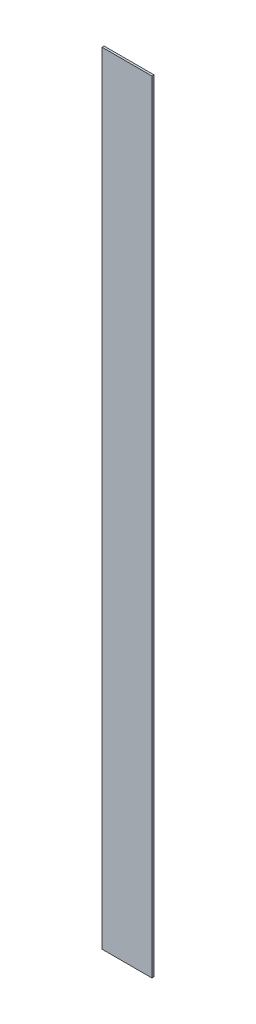
ISO-10303-21;
HEADER;
FILE_DESCRIPTION(('STEP AP214'),'2;1');
FILE_NAME('part.step','',(''),(''),'','','');
FILE_SCHEMA(('AUTOMOTIVE_DESIGN { 1 0 10303 214 1 1 1 1 }'));
ENDSEC;
DATA;
#1=APPLICATION_CONTEXT('core data for automotive mechanical design processes');
#2=APPLICATION_PROTOCOL_DEFINITION('international standard','automotive_design',2000,#1);
#3=PRODUCT_CONTEXT('',#1,'mechanical');
#4=PRODUCT('Part','Part','',(#3));
#5=PRODUCT_RELATED_PRODUCT_CATEGORY('part','',(#4));
#6=PRODUCT_DEFINITION_FORMATION('','',#4);
#7=PRODUCT_DEFINITION_CONTEXT('part definition',#1,'design');
#8=PRODUCT_DEFINITION('design','',#6,#7);
#9=PRODUCT_DEFINITION_SHAPE('','',#8);
#10=(LENGTH_UNIT() NAMED_UNIT(*) SI_UNIT(.MILLI.,.METRE.));
#11=(NAMED_UNIT(*) PLANE_ANGLE_UNIT() SI_UNIT($,.RADIAN.));
#12=(NAMED_UNIT(*) SI_UNIT($,.STERADIAN.) SOLID_ANGLE_UNIT());
#13=UNCERTAINTY_MEASURE_WITH_UNIT(LENGTH_MEASURE(1.E-05),#10,'distance_accuracy_value','');
#14=(GEOMETRIC_REPRESENTATION_CONTEXT(3) GLOBAL_UNCERTAINTY_ASSIGNED_CONTEXT((#13)) GLOBAL_UNIT_ASSIGNED_CONTEXT((#10,
#11,#12)) REPRESENTATION_CONTEXT('',''));
#15=CARTESIAN_POINT('',(0.,0.,0.));
#16=DIRECTION('',(0.,0.,1.));
#17=DIRECTION('',(1.,0.,0.));
#18=AXIS2_PLACEMENT_3D('',#15,#16,#17);
#19=CARTESIAN_POINT('',(-59.2525929806181,1415.46071241488,4.));
#20=DIRECTION('',(0.,1.,0.));
#21=DIRECTION('',(0.,0.,1.));
#22=AXIS2_PLACEMENT_3D('',#19,#20,#21);
#23=PLANE('',#22);
#24=DIRECTION('',(1.,0.,0.));
#25=VECTOR('',#24,1.);
#26=CARTESIAN_POINT('',(-59.2525929806181,1415.46071241488,0.));
#27=LINE('',#26,#25);
#28=CARTESIAN_POINT('',(-59.2525929806181,1415.46071241488,0.));
#29=VERTEX_POINT('',#28);
#30=CARTESIAN_POINT('',(36.7474070193817,1415.46071241488,0.));
#31=VERTEX_POINT('',#30);
#32=EDGE_CURVE('E97',#29,#31,#27,.T.);
#33=ORIENTED_EDGE('',*,*,#32,.F.);
#34=DIRECTION('',(0.,0.,-1.));
#35=VECTOR('',#34,1.);
#36=CARTESIAN_POINT('',(-59.2525929806181,1415.46071241488,4.));
#37=LINE('',#36,#35);
#38=CARTESIAN_POINT('',(-59.2525929806181,1415.46071241488,4.));
#39=VERTEX_POINT('',#38);
#40=EDGE_CURVE('E11',#39,#29,#37,.T.);
#41=ORIENTED_EDGE('',*,*,#40,.F.);
#42=DIRECTION('',(1.,0.,0.));
#43=VECTOR('',#42,1.);
#44=CARTESIAN_POINT('',(-59.2525929806181,1415.46071241488,4.));
#45=LINE('',#44,#43);
#46=CARTESIAN_POINT('',(36.7474070193817,1415.46071241488,4.));
#47=VERTEX_POINT('',#46);
#48=EDGE_CURVE('E91',#39,#47,#45,.T.);
#49=ORIENTED_EDGE('',*,*,#48,.T.);
#50=DIRECTION('',(0.,0.,-1.));
#51=VECTOR('',#50,1.);
#52=CARTESIAN_POINT('',(36.7474070193817,1415.46071241488,4.));
#53=LINE('',#52,#51);
#54=EDGE_CURVE('E36',#47,#31,#53,.T.);
#55=ORIENTED_EDGE('',*,*,#54,.T.);
#56=EDGE_LOOP('',(#33,#41,#49,#55));
#57=FACE_BOUND('',#56,.T.);
#58=ADVANCED_FACE('F33',(#57),#23,.T.);
#59=CARTESIAN_POINT('',(-59.2525929806181,-88.5392875851231,4.));
#60=DIRECTION('',(-1.,0.,0.));
#61=DIRECTION('',(0.,0.,1.));
#62=AXIS2_PLACEMENT_3D('',#59,#60,#61);
#63=PLANE('',#62);
#64=DIRECTION('',(0.,1.,0.));
#65=VECTOR('',#64,1.);
#66=CARTESIAN_POINT('',(-59.2525929806181,-88.5392875851231,0.));
#67=LINE('',#66,#65);
#68=CARTESIAN_POINT('',(-59.2525929806181,-88.5392875851231,0.));
#69=VERTEX_POINT('',#68);
#70=EDGE_CURVE('E93',#69,#29,#67,.T.);
#71=ORIENTED_EDGE('',*,*,#70,.F.);
#72=DIRECTION('',(0.,0.,-1.));
#73=VECTOR('',#72,1.);
#74=CARTESIAN_POINT('',(-59.2525929806181,-88.5392875851231,4.));
#75=LINE('',#74,#73);
#76=CARTESIAN_POINT('',(-59.2525929806181,-88.5392875851231,4.));
#77=VERTEX_POINT('',#76);
#78=EDGE_CURVE('E42',#77,#69,#75,.T.);
#79=ORIENTED_EDGE('',*,*,#78,.F.);
#80=DIRECTION('',(0.,1.,0.));
#81=VECTOR('',#80,1.);
#82=CARTESIAN_POINT('',(-59.2525929806181,-88.5392875851231,4.));
#83=LINE('',#82,#81);
#84=EDGE_CURVE('E88',#77,#39,#83,.T.);
#85=ORIENTED_EDGE('',*,*,#84,.T.);
#86=ORIENTED_EDGE('',*,*,#40,.T.);
#87=EDGE_LOOP('',(#71,#79,#85,#86));
#88=FACE_BOUND('',#87,.T.);
#89=ADVANCED_FACE('F107',(#88),#63,.T.);
#90=CARTESIAN_POINT('',(36.7474070193819,-88.5392875851231,4.));
#91=DIRECTION('',(0.,-1.,0.));
#92=DIRECTION('',(0.,0.,-1.));
#93=AXIS2_PLACEMENT_3D('',#90,#91,#92);
#94=PLANE('',#93);
#95=DIRECTION('',(-1.,0.,0.));
#96=VECTOR('',#95,1.);
#97=CARTESIAN_POINT('',(36.7474070193819,-88.5392875851231,0.));
#98=LINE('',#97,#96);
#99=CARTESIAN_POINT('',(36.7474070193819,-88.5392875851231,0.));
#100=VERTEX_POINT('',#99);
#101=EDGE_CURVE('E83',#100,#69,#98,.T.);
#102=ORIENTED_EDGE('',*,*,#101,.F.);
#103=DIRECTION('',(0.,0.,-1.));
#104=VECTOR('',#103,1.);
#105=CARTESIAN_POINT('',(36.7474070193819,-88.5392875851231,4.));
#106=LINE('',#105,#104);
#107=CARTESIAN_POINT('',(36.7474070193819,-88.5392875851231,4.));
#108=VERTEX_POINT('',#107);
#109=EDGE_CURVE('E78',#108,#100,#106,.T.);
#110=ORIENTED_EDGE('',*,*,#109,.F.);
#111=DIRECTION('',(-1.,0.,0.));
#112=VECTOR('',#111,1.);
#113=CARTESIAN_POINT('',(36.7474070193819,-88.5392875851231,4.));
#114=LINE('',#113,#112);
#115=EDGE_CURVE('E81',#108,#77,#114,.T.);
#116=ORIENTED_EDGE('',*,*,#115,.T.);
#117=ORIENTED_EDGE('',*,*,#78,.T.);
#118=EDGE_LOOP('',(#102,#110,#116,#117));
#119=FACE_BOUND('',#118,.T.);
#120=ADVANCED_FACE('F80',(#119),#94,.T.);
#121=CARTESIAN_POINT('',(36.7474070193817,1415.46071241488,4.));
#122=DIRECTION('',(1.,0.,0.));
#123=DIRECTION('',(0.,1.,0.));
#124=AXIS2_PLACEMENT_3D('',#121,#122,#123);
#125=PLANE('',#124);
#126=DIRECTION('',(0.,-1.,0.));
#127=VECTOR('',#126,1.);
#128=CARTESIAN_POINT('',(36.7474070193817,1415.46071241488,0.));
#129=LINE('',#128,#127);
#130=EDGE_CURVE('E100',#31,#100,#129,.T.);
#131=ORIENTED_EDGE('',*,*,#130,.F.);
#132=ORIENTED_EDGE('',*,*,#54,.F.);
#133=DIRECTION('',(0.,-1.,0.));
#134=VECTOR('',#133,1.);
#135=CARTESIAN_POINT('',(36.7474070193817,1415.46071241488,4.));
#136=LINE('',#135,#134);
#137=EDGE_CURVE('E87',#47,#108,#136,.T.);
#138=ORIENTED_EDGE('',*,*,#137,.T.);
#139=ORIENTED_EDGE('',*,*,#109,.T.);
#140=EDGE_LOOP('',(#131,#132,#138,#139));
#141=FACE_BOUND('',#140,.T.);
#142=ADVANCED_FACE('F90',(#141),#125,.T.);
#143=CARTESIAN_POINT('',(0.,0.,4.));
#144=DIRECTION('',(0.,0.,-1.));
#145=DIRECTION('',(-1.,0.,0.));
#146=AXIS2_PLACEMENT_3D('',#143,#144,#145);
#147=PLANE('',#146);
#148=ORIENTED_EDGE('',*,*,#48,.F.);
#149=ORIENTED_EDGE('',*,*,#84,.F.);
#150=ORIENTED_EDGE('',*,*,#115,.F.);
#151=ORIENTED_EDGE('',*,*,#137,.F.);
#152=EDGE_LOOP('',(#148,#149,#150,#151));
#153=FACE_BOUND('',#152,.T.);
#154=ADVANCED_FACE('F86',(#153),#147,.F.);
#155=CARTESIAN_POINT('',(0.,0.,0.));
#156=DIRECTION('',(0.,0.,-1.));
#157=DIRECTION('',(-1.,0.,0.));
#158=AXIS2_PLACEMENT_3D('',#155,#156,#157);
#159=PLANE('',#158);
#160=ORIENTED_EDGE('',*,*,#32,.T.);
#161=ORIENTED_EDGE('',*,*,#130,.T.);
#162=ORIENTED_EDGE('',*,*,#101,.T.);
#163=ORIENTED_EDGE('',*,*,#70,.T.);
#164=EDGE_LOOP('',(#160,#161,#162,#163));
#165=FACE_BOUND('',#164,.T.);
#166=ADVANCED_FACE('F106',(#165),#159,.T.);
#167=CLOSED_SHELL('',(#58,#89,#120,#142,#154,#166));
#168=MANIFOLD_SOLID_BREP('B2',#167);
#169=ADVANCED_BREP_SHAPE_REPRESENTATION('',(#18,#168),#14);
#170=SHAPE_DEFINITION_REPRESENTATION(#9,#169);
ENDSEC;
END-ISO-10303-21;
